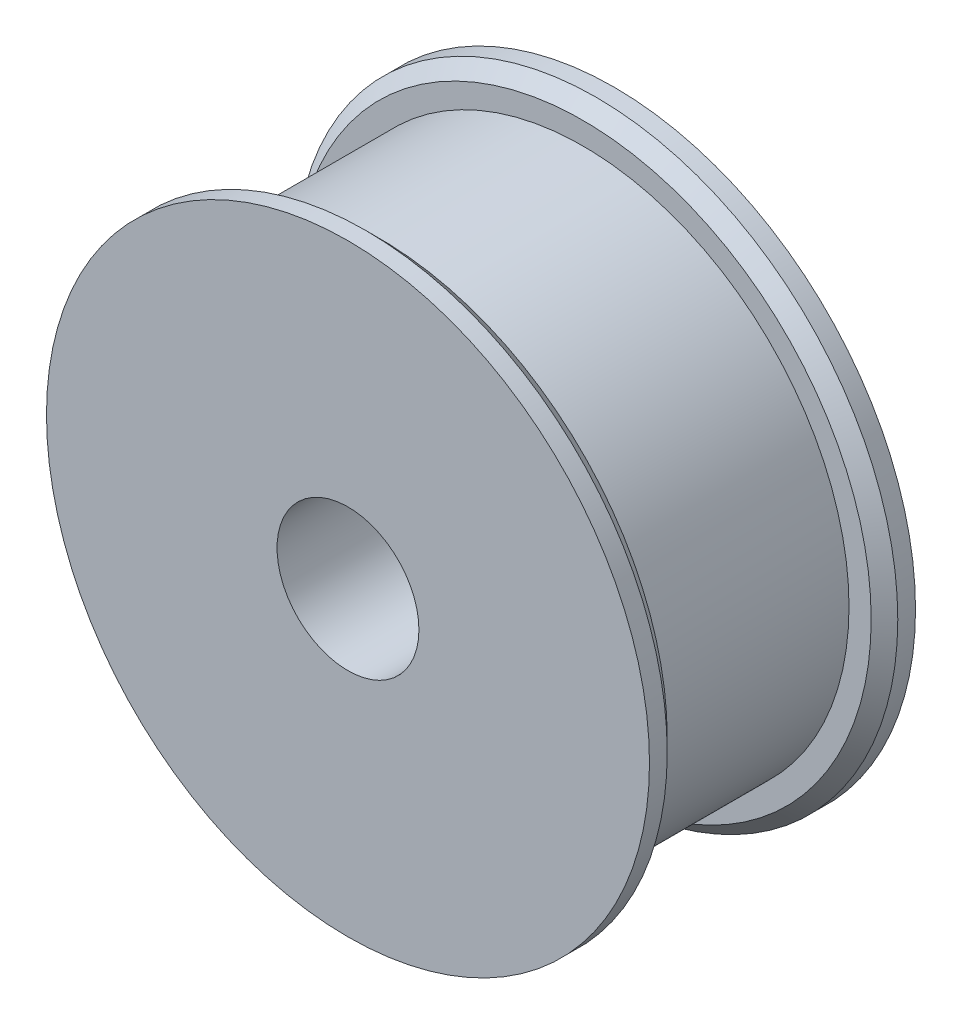
ISO-10303-21;
HEADER;
FILE_DESCRIPTION(('STEP AP214'),'2;1');
FILE_NAME('part.step','',(''),(''),'','','');
FILE_SCHEMA(('AUTOMOTIVE_DESIGN { 1 0 10303 214 1 1 1 1 }'));
ENDSEC;
DATA;
#1=APPLICATION_CONTEXT('core data for automotive mechanical design processes');
#2=APPLICATION_PROTOCOL_DEFINITION('international standard','automotive_design',2000,#1);
#3=PRODUCT_CONTEXT('',#1,'mechanical');
#4=PRODUCT('Part','Part','',(#3));
#5=PRODUCT_RELATED_PRODUCT_CATEGORY('part','',(#4));
#6=PRODUCT_DEFINITION_FORMATION('','',#4);
#7=PRODUCT_DEFINITION_CONTEXT('part definition',#1,'design');
#8=PRODUCT_DEFINITION('design','',#6,#7);
#9=PRODUCT_DEFINITION_SHAPE('','',#8);
#10=(LENGTH_UNIT() NAMED_UNIT(*) SI_UNIT(.MILLI.,.METRE.));
#11=(NAMED_UNIT(*) PLANE_ANGLE_UNIT() SI_UNIT($,.RADIAN.));
#12=(NAMED_UNIT(*) SI_UNIT($,.STERADIAN.) SOLID_ANGLE_UNIT());
#13=UNCERTAINTY_MEASURE_WITH_UNIT(LENGTH_MEASURE(1.E-05),#10,'distance_accuracy_value','');
#14=(GEOMETRIC_REPRESENTATION_CONTEXT(3) GLOBAL_UNCERTAINTY_ASSIGNED_CONTEXT((#13)) GLOBAL_UNIT_ASSIGNED_CONTEXT((#10,
#11,#12)) REPRESENTATION_CONTEXT('',''));
#15=CARTESIAN_POINT('',(0.,0.,0.));
#16=DIRECTION('',(0.,0.,1.));
#17=DIRECTION('',(1.,0.,0.));
#18=AXIS2_PLACEMENT_3D('',#15,#16,#17);
#19=CARTESIAN_POINT('',(0.,0.,15.));
#20=DIRECTION('',(0.,0.,1.));
#21=DIRECTION('',(1.,0.,0.));
#22=AXIS2_PLACEMENT_3D('',#19,#20,#21);
#23=PLANE('',#22);
#24=CARTESIAN_POINT('',(0.,0.,15.));
#25=DIRECTION('',(0.,0.,1.));
#26=DIRECTION('',(1.,0.,0.));
#27=AXIS2_PLACEMENT_3D('',#24,#25,#26);
#28=CIRCLE('',#27,17.);
#29=CARTESIAN_POINT('',(17.,0.,15.));
#30=VERTEX_POINT('',#29);
#31=EDGE_CURVE('E68',#30,#30,#28,.T.);
#32=ORIENTED_EDGE('',*,*,#31,.T.);
#33=EDGE_LOOP('',(#32));
#34=FACE_BOUND('',#33,.T.);
#35=CARTESIAN_POINT('',(0.,0.,15.));
#36=DIRECTION('',(0.,0.,1.));
#37=DIRECTION('',(1.,0.,0.));
#38=AXIS2_PLACEMENT_3D('',#35,#36,#37);
#39=CIRCLE('',#38,4.);
#40=CARTESIAN_POINT('',(4.,0.,15.));
#41=VERTEX_POINT('',#40);
#42=EDGE_CURVE('E53',#41,#41,#39,.T.);
#43=ORIENTED_EDGE('',*,*,#42,.F.);
#44=EDGE_LOOP('',(#43));
#45=FACE_BOUND('',#44,.T.);
#46=ADVANCED_FACE('F33',(#34,#45),#23,.T.);
#47=CARTESIAN_POINT('',(0.,0.,15.));
#48=DIRECTION('',(0.,0.,1.));
#49=DIRECTION('',(1.,0.,0.));
#50=AXIS2_PLACEMENT_3D('',#47,#48,#49);
#51=CYLINDRICAL_SURFACE('',#50,4.);
#52=CARTESIAN_POINT('',(0.,0.,0.));
#53=DIRECTION('',(0.,0.,1.));
#54=DIRECTION('',(1.,0.,0.));
#55=AXIS2_PLACEMENT_3D('',#52,#53,#54);
#56=CIRCLE('',#55,4.);
#57=CARTESIAN_POINT('',(4.,0.,0.));
#58=VERTEX_POINT('',#57);
#59=EDGE_CURVE('E56',#58,#58,#56,.T.);
#60=ORIENTED_EDGE('',*,*,#59,.F.);
#61=EDGE_LOOP('',(#60));
#62=FACE_BOUND('',#61,.T.);
#63=ORIENTED_EDGE('',*,*,#42,.T.);
#64=EDGE_LOOP('',(#63));
#65=FACE_BOUND('',#64,.T.);
#66=ADVANCED_FACE('F87',(#62,#65),#51,.F.);
#67=CARTESIAN_POINT('',(0.,0.,0.));
#68=DIRECTION('',(0.,0.,1.));
#69=DIRECTION('',(1.,0.,0.));
#70=AXIS2_PLACEMENT_3D('',#67,#68,#69);
#71=PLANE('',#70);
#72=CARTESIAN_POINT('',(0.,0.,0.));
#73=DIRECTION('',(0.,0.,1.));
#74=DIRECTION('',(1.,0.,0.));
#75=AXIS2_PLACEMENT_3D('',#72,#73,#74);
#76=CIRCLE('',#75,17.);
#77=CARTESIAN_POINT('',(17.,0.,0.));
#78=VERTEX_POINT('',#77);
#79=EDGE_CURVE('E59',#78,#78,#76,.T.);
#80=ORIENTED_EDGE('',*,*,#79,.F.);
#81=EDGE_LOOP('',(#80));
#82=FACE_BOUND('',#81,.T.);
#83=ORIENTED_EDGE('',*,*,#59,.T.);
#84=EDGE_LOOP('',(#83));
#85=FACE_BOUND('',#84,.T.);
#86=ADVANCED_FACE('F92',(#82,#85),#71,.F.);
#87=CARTESIAN_POINT('',(0.,0.,15.));
#88=DIRECTION('',(0.,0.,1.));
#89=DIRECTION('',(1.,0.,0.));
#90=AXIS2_PLACEMENT_3D('',#87,#88,#89);
#91=CYLINDRICAL_SURFACE('',#90,17.);
#92=CARTESIAN_POINT('',(0.,0.,0.999999999999992));
#93=DIRECTION('',(0.,0.,1.));
#94=DIRECTION('',(1.,0.,0.));
#95=AXIS2_PLACEMENT_3D('',#92,#93,#94);
#96=CIRCLE('',#95,17.);
#97=CARTESIAN_POINT('',(17.,0.,0.999999999999992));
#98=VERTEX_POINT('',#97);
#99=EDGE_CURVE('E44',#98,#98,#96,.F.);
#100=ORIENTED_EDGE('',*,*,#99,.T.);
#101=EDGE_LOOP('',(#100));
#102=FACE_BOUND('',#101,.T.);
#103=ORIENTED_EDGE('',*,*,#79,.T.);
#104=EDGE_LOOP('',(#103));
#105=FACE_BOUND('',#104,.T.);
#106=ADVANCED_FACE('F98',(#102,#105),#91,.T.);
#107=CARTESIAN_POINT('',(0.,0.,1.75));
#108=DIRECTION('',(0.,0.,1.));
#109=DIRECTION('',(1.,0.,0.));
#110=AXIS2_PLACEMENT_3D('',#107,#108,#109);
#111=PLANE('',#110);
#112=CARTESIAN_POINT('',(0.,0.,1.75));
#113=DIRECTION('',(0.,0.,1.));
#114=DIRECTION('',(1.,0.,0.));
#115=AXIS2_PLACEMENT_3D('',#112,#113,#114);
#116=CIRCLE('',#115,16.25);
#117=CARTESIAN_POINT('',(16.25,0.,1.75));
#118=VERTEX_POINT('',#117);
#119=EDGE_CURVE('E48',#118,#118,#116,.T.);
#120=ORIENTED_EDGE('',*,*,#119,.T.);
#121=EDGE_LOOP('',(#120));
#122=FACE_BOUND('',#121,.T.);
#123=CARTESIAN_POINT('',(0.,0.,1.75));
#124=DIRECTION('',(0.,0.,1.));
#125=DIRECTION('',(1.,0.,0.));
#126=AXIS2_PLACEMENT_3D('',#123,#124,#125);
#127=CIRCLE('',#126,15.);
#128=CARTESIAN_POINT('',(15.,0.,1.75));
#129=VERTEX_POINT('',#128);
#130=EDGE_CURVE('E62',#129,#129,#127,.T.);
#131=ORIENTED_EDGE('',*,*,#130,.F.);
#132=EDGE_LOOP('',(#131));
#133=FACE_BOUND('',#132,.T.);
#134=ADVANCED_FACE('F102',(#122,#133),#111,.T.);
#135=CARTESIAN_POINT('',(0.,0.,15.));
#136=DIRECTION('',(0.,0.,1.));
#137=DIRECTION('',(1.,0.,0.));
#138=AXIS2_PLACEMENT_3D('',#135,#136,#137);
#139=CYLINDRICAL_SURFACE('',#138,15.);
#140=ORIENTED_EDGE('',*,*,#130,.T.);
#141=EDGE_LOOP('',(#140));
#142=FACE_BOUND('',#141,.T.);
#143=CARTESIAN_POINT('',(0.,0.,13.25));
#144=DIRECTION('',(0.,0.,1.));
#145=DIRECTION('',(1.,0.,0.));
#146=AXIS2_PLACEMENT_3D('',#143,#144,#145);
#147=CIRCLE('',#146,15.);
#148=CARTESIAN_POINT('',(15.,0.,13.25));
#149=VERTEX_POINT('',#148);
#150=EDGE_CURVE('E65',#149,#149,#147,.T.);
#151=ORIENTED_EDGE('',*,*,#150,.F.);
#152=EDGE_LOOP('',(#151));
#153=FACE_BOUND('',#152,.T.);
#154=ADVANCED_FACE('F84',(#142,#153),#139,.T.);
#155=CARTESIAN_POINT('',(0.,0.,13.25));
#156=DIRECTION('',(0.,0.,1.));
#157=DIRECTION('',(1.,0.,0.));
#158=AXIS2_PLACEMENT_3D('',#155,#156,#157);
#159=PLANE('',#158);
#160=CARTESIAN_POINT('',(0.,0.,13.25));
#161=DIRECTION('',(0.,0.,1.));
#162=DIRECTION('',(1.,0.,0.));
#163=AXIS2_PLACEMENT_3D('',#160,#161,#162);
#164=CIRCLE('',#163,16.25);
#165=CARTESIAN_POINT('',(16.25,0.,13.25));
#166=VERTEX_POINT('',#165);
#167=EDGE_CURVE('E10',#166,#166,#164,.F.);
#168=ORIENTED_EDGE('',*,*,#167,.T.);
#169=EDGE_LOOP('',(#168));
#170=FACE_BOUND('',#169,.T.);
#171=ORIENTED_EDGE('',*,*,#150,.T.);
#172=EDGE_LOOP('',(#171));
#173=FACE_BOUND('',#172,.T.);
#174=ADVANCED_FACE('F77',(#170,#173),#159,.F.);
#175=CARTESIAN_POINT('',(0.,0.,15.));
#176=DIRECTION('',(0.,0.,1.));
#177=DIRECTION('',(1.,0.,0.));
#178=AXIS2_PLACEMENT_3D('',#175,#176,#177);
#179=CYLINDRICAL_SURFACE('',#178,17.);
#180=CARTESIAN_POINT('',(0.,0.,14.));
#181=DIRECTION('',(0.,0.,1.));
#182=DIRECTION('',(1.,0.,0.));
#183=AXIS2_PLACEMENT_3D('',#180,#181,#182);
#184=CIRCLE('',#183,17.);
#185=CARTESIAN_POINT('',(17.,0.,14.));
#186=VERTEX_POINT('',#185);
#187=EDGE_CURVE('E40',#186,#186,#184,.T.);
#188=ORIENTED_EDGE('',*,*,#187,.T.);
#189=EDGE_LOOP('',(#188));
#190=FACE_BOUND('',#189,.T.);
#191=ORIENTED_EDGE('',*,*,#31,.F.);
#192=EDGE_LOOP('',(#191));
#193=FACE_BOUND('',#192,.T.);
#194=ADVANCED_FACE('F74',(#190,#193),#179,.T.);
#195=CARTESIAN_POINT('',(0.,0.,1.75));
#196=DIRECTION('',(0.,0.,-1.));
#197=DIRECTION('',(-1.,0.,0.));
#198=AXIS2_PLACEMENT_3D('',#195,#196,#197);
#199=CONICAL_SURFACE('',#198,16.25,0.785398163397448);
#200=ORIENTED_EDGE('',*,*,#99,.F.);
#201=EDGE_LOOP('',(#200));
#202=FACE_BOUND('',#201,.T.);
#203=ORIENTED_EDGE('',*,*,#119,.F.);
#204=EDGE_LOOP('',(#203));
#205=FACE_BOUND('',#204,.T.);
#206=ADVANCED_FACE('F76',(#202,#205),#199,.T.);
#207=CARTESIAN_POINT('',(0.,0.,14.));
#208=DIRECTION('',(0.,0.,1.));
#209=DIRECTION('',(1.,0.,0.));
#210=AXIS2_PLACEMENT_3D('',#207,#208,#209);
#211=CONICAL_SURFACE('',#210,17.,0.785398163397453);
#212=ORIENTED_EDGE('',*,*,#167,.F.);
#213=EDGE_LOOP('',(#212));
#214=FACE_BOUND('',#213,.T.);
#215=ORIENTED_EDGE('',*,*,#187,.F.);
#216=EDGE_LOOP('',(#215));
#217=FACE_BOUND('',#216,.T.);
#218=ADVANCED_FACE('F35',(#214,#217),#211,.T.);
#219=CLOSED_SHELL('',(#46,#66,#86,#106,#134,#154,#174,#194,#206,#218));
#220=MANIFOLD_SOLID_BREP('B2',#219);
#221=ADVANCED_BREP_SHAPE_REPRESENTATION('',(#18,#220),#14);
#222=SHAPE_DEFINITION_REPRESENTATION(#9,#221);
ENDSEC;
END-ISO-10303-21;
